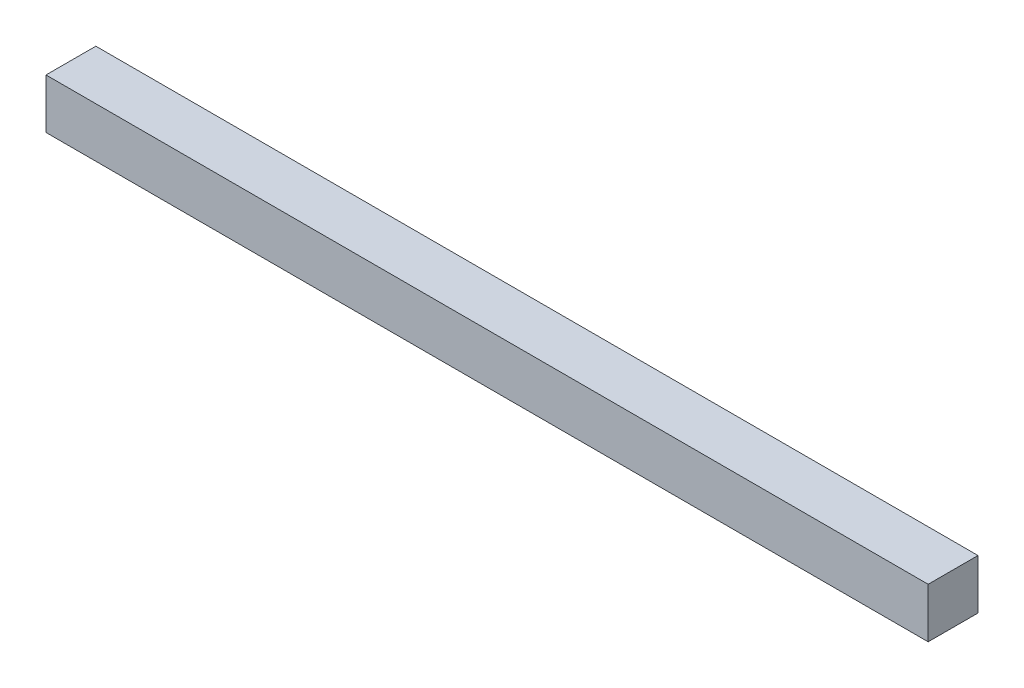
ISO-10303-21;
HEADER;
FILE_DESCRIPTION(('STEP AP214'),'2;1');
FILE_NAME('part.step','',(''),(''),'','','');
FILE_SCHEMA(('AUTOMOTIVE_DESIGN { 1 0 10303 214 1 1 1 1 }'));
ENDSEC;
DATA;
#1=APPLICATION_CONTEXT('core data for automotive mechanical design processes');
#2=APPLICATION_PROTOCOL_DEFINITION('international standard','automotive_design',2000,#1);
#3=PRODUCT_CONTEXT('',#1,'mechanical');
#4=PRODUCT('Part','Part','',(#3));
#5=PRODUCT_RELATED_PRODUCT_CATEGORY('part','',(#4));
#6=PRODUCT_DEFINITION_FORMATION('','',#4);
#7=PRODUCT_DEFINITION_CONTEXT('part definition',#1,'design');
#8=PRODUCT_DEFINITION('design','',#6,#7);
#9=PRODUCT_DEFINITION_SHAPE('','',#8);
#10=(LENGTH_UNIT() NAMED_UNIT(*) SI_UNIT(.MILLI.,.METRE.));
#11=(NAMED_UNIT(*) PLANE_ANGLE_UNIT() SI_UNIT($,.RADIAN.));
#12=(NAMED_UNIT(*) SI_UNIT($,.STERADIAN.) SOLID_ANGLE_UNIT());
#13=UNCERTAINTY_MEASURE_WITH_UNIT(LENGTH_MEASURE(1.E-05),#10,'distance_accuracy_value','');
#14=(GEOMETRIC_REPRESENTATION_CONTEXT(3) GLOBAL_UNCERTAINTY_ASSIGNED_CONTEXT((#13)) GLOBAL_UNIT_ASSIGNED_CONTEXT((#10,
#11,#12)) REPRESENTATION_CONTEXT('',''));
#15=CARTESIAN_POINT('',(0.,0.,0.));
#16=DIRECTION('',(0.,0.,1.));
#17=DIRECTION('',(1.,0.,0.));
#18=AXIS2_PLACEMENT_3D('',#15,#16,#17);
#19=CARTESIAN_POINT('',(-116.223225214198,39.1860465116279,10.));
#20=DIRECTION('',(1.,0.,0.));
#21=DIRECTION('',(0.,0.,-1.));
#22=AXIS2_PLACEMENT_3D('',#19,#20,#21);
#23=PLANE('',#22);
#24=DIRECTION('',(0.,-1.,0.));
#25=VECTOR('',#24,1.);
#26=CARTESIAN_POINT('',(-116.223225214198,39.1860465116279,0.));
#27=LINE('',#26,#25);
#28=CARTESIAN_POINT('',(-116.223225214198,39.1860465116279,0.));
#29=VERTEX_POINT('',#28);
#30=CARTESIAN_POINT('',(-116.223225214198,29.1860465116279,0.));
#31=VERTEX_POINT('',#30);
#32=EDGE_CURVE('E96',#29,#31,#27,.T.);
#33=ORIENTED_EDGE('',*,*,#32,.T.);
#34=DIRECTION('',(0.,0.,-1.));
#35=VECTOR('',#34,1.);
#36=CARTESIAN_POINT('',(-116.223225214198,29.1860465116279,10.));
#37=LINE('',#36,#35);
#38=CARTESIAN_POINT('',(-116.223225214198,29.1860465116279,10.));
#39=VERTEX_POINT('',#38);
#40=EDGE_CURVE('E11',#39,#31,#37,.T.);
#41=ORIENTED_EDGE('',*,*,#40,.F.);
#42=DIRECTION('',(0.,-1.,0.));
#43=VECTOR('',#42,1.);
#44=CARTESIAN_POINT('',(-116.223225214198,39.1860465116279,10.));
#45=LINE('',#44,#43);
#46=CARTESIAN_POINT('',(-116.223225214198,39.1860465116279,10.));
#47=VERTEX_POINT('',#46);
#48=EDGE_CURVE('E84',#47,#39,#45,.T.);
#49=ORIENTED_EDGE('',*,*,#48,.F.);
#50=DIRECTION('',(0.,0.,-1.));
#51=VECTOR('',#50,1.);
#52=CARTESIAN_POINT('',(-116.223225214198,39.1860465116279,10.));
#53=LINE('',#52,#51);
#54=EDGE_CURVE('E92',#47,#29,#53,.T.);
#55=ORIENTED_EDGE('',*,*,#54,.T.);
#56=EDGE_LOOP('',(#33,#41,#49,#55));
#57=FACE_BOUND('',#56,.T.);
#58=ADVANCED_FACE('F33',(#57),#23,.F.);
#59=CARTESIAN_POINT('',(-116.223225214198,29.1860465116279,10.));
#60=DIRECTION('',(0.,1.,0.));
#61=DIRECTION('',(-1.,0.,0.));
#62=AXIS2_PLACEMENT_3D('',#59,#60,#61);
#63=PLANE('',#62);
#64=DIRECTION('',(1.,0.,0.));
#65=VECTOR('',#64,1.);
#66=CARTESIAN_POINT('',(-116.223225214198,29.1860465116279,0.));
#67=LINE('',#66,#65);
#68=CARTESIAN_POINT('',(60.7767747858017,29.1860465116279,0.));
#69=VERTEX_POINT('',#68);
#70=EDGE_CURVE('E88',#31,#69,#67,.T.);
#71=ORIENTED_EDGE('',*,*,#70,.T.);
#72=DIRECTION('',(0.,0.,-1.));
#73=VECTOR('',#72,1.);
#74=CARTESIAN_POINT('',(60.7767747858017,29.1860465116279,10.));
#75=LINE('',#74,#73);
#76=CARTESIAN_POINT('',(60.7767747858017,29.1860465116279,10.));
#77=VERTEX_POINT('',#76);
#78=EDGE_CURVE('E41',#77,#69,#75,.T.);
#79=ORIENTED_EDGE('',*,*,#78,.F.);
#80=DIRECTION('',(1.,0.,0.));
#81=VECTOR('',#80,1.);
#82=CARTESIAN_POINT('',(-116.223225214198,29.1860465116279,10.));
#83=LINE('',#82,#81);
#84=EDGE_CURVE('E79',#39,#77,#83,.T.);
#85=ORIENTED_EDGE('',*,*,#84,.F.);
#86=ORIENTED_EDGE('',*,*,#40,.T.);
#87=EDGE_LOOP('',(#71,#79,#85,#86));
#88=FACE_BOUND('',#87,.T.);
#89=ADVANCED_FACE('F87',(#88),#63,.F.);
#90=CARTESIAN_POINT('',(60.7767747858017,39.1860465116279,10.));
#91=DIRECTION('',(-1.,0.,0.));
#92=DIRECTION('',(0.,0.,1.));
#93=AXIS2_PLACEMENT_3D('',#90,#91,#92);
#94=PLANE('',#93);
#95=DIRECTION('',(0.,1.,0.));
#96=VECTOR('',#95,1.);
#97=CARTESIAN_POINT('',(60.7767747858017,39.1860465116279,0.));
#98=LINE('',#97,#96);
#99=CARTESIAN_POINT('',(60.7767747858017,39.1860465116279,0.));
#100=VERTEX_POINT('',#99);
#101=EDGE_CURVE('E66',#69,#100,#98,.T.);
#102=ORIENTED_EDGE('',*,*,#101,.T.);
#103=DIRECTION('',(0.,0.,-1.));
#104=VECTOR('',#103,1.);
#105=CARTESIAN_POINT('',(60.7767747858017,39.1860465116279,10.));
#106=LINE('',#105,#104);
#107=CARTESIAN_POINT('',(60.7767747858017,39.1860465116279,10.));
#108=VERTEX_POINT('',#107);
#109=EDGE_CURVE('E89',#108,#100,#106,.T.);
#110=ORIENTED_EDGE('',*,*,#109,.F.);
#111=DIRECTION('',(0.,1.,0.));
#112=VECTOR('',#111,1.);
#113=CARTESIAN_POINT('',(60.7767747858017,39.1860465116279,10.));
#114=LINE('',#113,#112);
#115=EDGE_CURVE('E82',#77,#108,#114,.T.);
#116=ORIENTED_EDGE('',*,*,#115,.F.);
#117=ORIENTED_EDGE('',*,*,#78,.T.);
#118=EDGE_LOOP('',(#102,#110,#116,#117));
#119=FACE_BOUND('',#118,.T.);
#120=ADVANCED_FACE('F90',(#119),#94,.F.);
#121=CARTESIAN_POINT('',(-116.223225214198,39.1860465116279,10.));
#122=DIRECTION('',(0.,-1.,0.));
#123=DIRECTION('',(0.,0.,-1.));
#124=AXIS2_PLACEMENT_3D('',#121,#122,#123);
#125=PLANE('',#124);
#126=DIRECTION('',(-1.,0.,0.));
#127=VECTOR('',#126,1.);
#128=CARTESIAN_POINT('',(-116.223225214198,39.1860465116279,0.));
#129=LINE('',#128,#127);
#130=EDGE_CURVE('E72',#100,#29,#129,.T.);
#131=ORIENTED_EDGE('',*,*,#130,.T.);
#132=ORIENTED_EDGE('',*,*,#54,.F.);
#133=DIRECTION('',(-1.,0.,0.));
#134=VECTOR('',#133,1.);
#135=CARTESIAN_POINT('',(-116.223225214198,39.1860465116279,10.));
#136=LINE('',#135,#134);
#137=EDGE_CURVE('E49',#108,#47,#136,.T.);
#138=ORIENTED_EDGE('',*,*,#137,.F.);
#139=ORIENTED_EDGE('',*,*,#109,.T.);
#140=EDGE_LOOP('',(#131,#132,#138,#139));
#141=FACE_BOUND('',#140,.T.);
#142=ADVANCED_FACE('F103',(#141),#125,.F.);
#143=CARTESIAN_POINT('',(0.,0.,10.));
#144=DIRECTION('',(0.,0.,1.));
#145=DIRECTION('',(1.,0.,0.));
#146=AXIS2_PLACEMENT_3D('',#143,#144,#145);
#147=PLANE('',#146);
#148=ORIENTED_EDGE('',*,*,#48,.T.);
#149=ORIENTED_EDGE('',*,*,#84,.T.);
#150=ORIENTED_EDGE('',*,*,#115,.T.);
#151=ORIENTED_EDGE('',*,*,#137,.T.);
#152=EDGE_LOOP('',(#148,#149,#150,#151));
#153=FACE_BOUND('',#152,.T.);
#154=ADVANCED_FACE('F80',(#153),#147,.T.);
#155=CARTESIAN_POINT('',(0.,0.,0.));
#156=DIRECTION('',(0.,0.,1.));
#157=DIRECTION('',(1.,0.,0.));
#158=AXIS2_PLACEMENT_3D('',#155,#156,#157);
#159=PLANE('',#158);
#160=ORIENTED_EDGE('',*,*,#32,.F.);
#161=ORIENTED_EDGE('',*,*,#130,.F.);
#162=ORIENTED_EDGE('',*,*,#101,.F.);
#163=ORIENTED_EDGE('',*,*,#70,.F.);
#164=EDGE_LOOP('',(#160,#161,#162,#163));
#165=FACE_BOUND('',#164,.T.);
#166=ADVANCED_FACE('F106',(#165),#159,.F.);
#167=CLOSED_SHELL('',(#58,#89,#120,#142,#154,#166));
#168=MANIFOLD_SOLID_BREP('B2',#167);
#169=ADVANCED_BREP_SHAPE_REPRESENTATION('',(#18,#168),#14);
#170=SHAPE_DEFINITION_REPRESENTATION(#9,#169);
ENDSEC;
END-ISO-10303-21;
